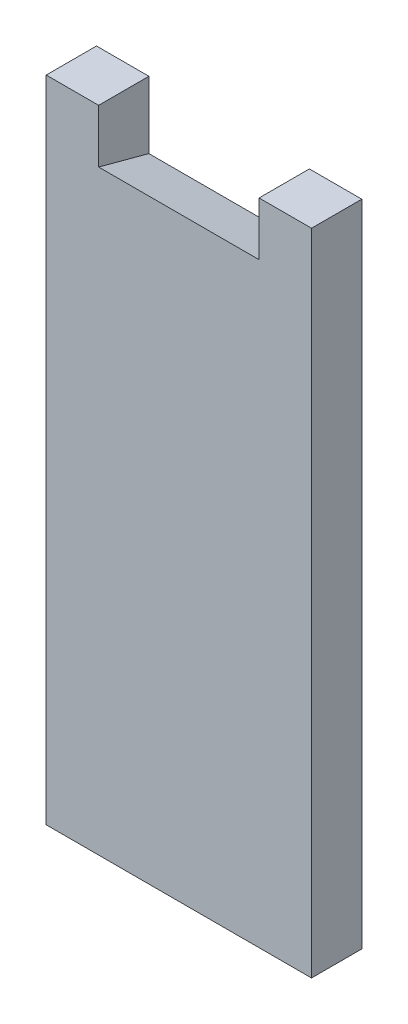
ISO-10303-21;
HEADER;
FILE_DESCRIPTION(('STEP AP214'),'2;1');
FILE_NAME('part.step','',(''),(''),'','','');
FILE_SCHEMA(('AUTOMOTIVE_DESIGN { 1 0 10303 214 1 1 1 1 }'));
ENDSEC;
DATA;
#1=APPLICATION_CONTEXT('core data for automotive mechanical design processes');
#2=APPLICATION_PROTOCOL_DEFINITION('international standard','automotive_design',2000,#1);
#3=PRODUCT_CONTEXT('',#1,'mechanical');
#4=PRODUCT('Part','Part','',(#3));
#5=PRODUCT_RELATED_PRODUCT_CATEGORY('part','',(#4));
#6=PRODUCT_DEFINITION_FORMATION('','',#4);
#7=PRODUCT_DEFINITION_CONTEXT('part definition',#1,'design');
#8=PRODUCT_DEFINITION('design','',#6,#7);
#9=PRODUCT_DEFINITION_SHAPE('','',#8);
#10=(LENGTH_UNIT() NAMED_UNIT(*) SI_UNIT(.MILLI.,.METRE.));
#11=(NAMED_UNIT(*) PLANE_ANGLE_UNIT() SI_UNIT($,.RADIAN.));
#12=(NAMED_UNIT(*) SI_UNIT($,.STERADIAN.) SOLID_ANGLE_UNIT());
#13=UNCERTAINTY_MEASURE_WITH_UNIT(LENGTH_MEASURE(1.E-05),#10,'distance_accuracy_value','');
#14=(GEOMETRIC_REPRESENTATION_CONTEXT(3) GLOBAL_UNCERTAINTY_ASSIGNED_CONTEXT((#13)) GLOBAL_UNIT_ASSIGNED_CONTEXT((#10,
#11,#12)) REPRESENTATION_CONTEXT('',''));
#15=CARTESIAN_POINT('',(0.,0.,0.));
#16=DIRECTION('',(0.,0.,1.));
#17=DIRECTION('',(1.,0.,0.));
#18=AXIS2_PLACEMENT_3D('',#15,#16,#17);
#19=CARTESIAN_POINT('',(0.,0.,9.4));
#20=DIRECTION('',(0.,1.,0.));
#21=DIRECTION('',(0.,0.,1.));
#22=AXIS2_PLACEMENT_3D('',#19,#20,#21);
#23=PLANE('',#22);
#24=DIRECTION('',(1.,0.,0.));
#25=VECTOR('',#24,1.);
#26=CARTESIAN_POINT('',(0.,0.,0.));
#27=LINE('',#26,#25);
#28=CARTESIAN_POINT('',(39.8,0.,0.));
#29=VERTEX_POINT('',#28);
#30=CARTESIAN_POINT('',(49.6,0.,0.));
#31=VERTEX_POINT('',#30);
#32=EDGE_CURVE('E117',#29,#31,#27,.T.);
#33=ORIENTED_EDGE('',*,*,#32,.F.);
#34=DIRECTION('',(0.,0.,-1.));
#35=VECTOR('',#34,1.);
#36=CARTESIAN_POINT('',(39.8,0.,9.4));
#37=LINE('',#36,#35);
#38=CARTESIAN_POINT('',(39.8,0.,9.4));
#39=VERTEX_POINT('',#38);
#40=EDGE_CURVE('E11',#39,#29,#37,.T.);
#41=ORIENTED_EDGE('',*,*,#40,.F.);
#42=DIRECTION('',(1.,0.,0.));
#43=VECTOR('',#42,1.);
#44=CARTESIAN_POINT('',(0.,0.,9.4));
#45=LINE('',#44,#43);
#46=CARTESIAN_POINT('',(49.6,0.,9.4));
#47=VERTEX_POINT('',#46);
#48=EDGE_CURVE('E127',#39,#47,#45,.T.);
#49=ORIENTED_EDGE('',*,*,#48,.T.);
#50=DIRECTION('',(0.,0.,-1.));
#51=VECTOR('',#50,1.);
#52=CARTESIAN_POINT('',(49.6,0.,9.4));
#53=LINE('',#52,#51);
#54=EDGE_CURVE('E58',#47,#31,#53,.T.);
#55=ORIENTED_EDGE('',*,*,#54,.T.);
#56=EDGE_LOOP('',(#33,#41,#49,#55));
#57=FACE_BOUND('',#56,.T.);
#58=ADVANCED_FACE('F39',(#57),#23,.T.);
#59=CARTESIAN_POINT('',(39.8,0.,9.4));
#60=DIRECTION('',(1.,0.,0.));
#61=DIRECTION('',(0.,0.,-1.));
#62=AXIS2_PLACEMENT_3D('',#59,#60,#61);
#63=PLANE('',#62);
#64=DIRECTION('',(0.,-1.,0.));
#65=VECTOR('',#64,1.);
#66=CARTESIAN_POINT('',(39.8,0.,0.));
#67=LINE('',#66,#65);
#68=CARTESIAN_POINT('',(39.8,-12.5187224088526,0.));
#69=VERTEX_POINT('',#68);
#70=EDGE_CURVE('E107',#29,#69,#67,.T.);
#71=ORIENTED_EDGE('',*,*,#70,.T.);
#72=DIRECTION('',(0.,-0.258819045102521,-0.965925826289068));
#73=VECTOR('',#72,1.);
#74=CARTESIAN_POINT('',(39.8,-9.99999999999999,9.4));
#75=LINE('',#74,#73);
#76=CARTESIAN_POINT('',(39.8,-9.99999999999999,9.4));
#77=VERTEX_POINT('',#76);
#78=EDGE_CURVE('E49',#77,#69,#75,.T.);
#79=ORIENTED_EDGE('',*,*,#78,.F.);
#80=DIRECTION('',(0.,-1.,0.));
#81=VECTOR('',#80,1.);
#82=CARTESIAN_POINT('',(39.8,0.,9.4));
#83=LINE('',#82,#81);
#84=EDGE_CURVE('E155',#39,#77,#83,.T.);
#85=ORIENTED_EDGE('',*,*,#84,.F.);
#86=ORIENTED_EDGE('',*,*,#40,.T.);
#87=EDGE_LOOP('',(#71,#79,#85,#86));
#88=FACE_BOUND('',#87,.T.);
#89=ADVANCED_FACE('F164',(#88),#63,.F.);
#90=CARTESIAN_POINT('',(0.,-10.,9.4));
#91=DIRECTION('',(0.,0.965925826289068,-0.258819045102521));
#92=DIRECTION('',(0.,0.258819045102521,0.965925826289068));
#93=AXIS2_PLACEMENT_3D('',#90,#91,#92);
#94=PLANE('',#93);
#95=DIRECTION('',(1.,0.,0.));
#96=VECTOR('',#95,1.);
#97=CARTESIAN_POINT('',(0.,-12.5187224088526,0.));
#98=LINE('',#97,#96);
#99=CARTESIAN_POINT('',(9.79999999999999,-12.5187224088526,0.));
#100=VERTEX_POINT('',#99);
#101=EDGE_CURVE('E104',#100,#69,#98,.T.);
#102=ORIENTED_EDGE('',*,*,#101,.F.);
#103=DIRECTION('',(0.,-0.258819045102521,-0.965925826289068));
#104=VECTOR('',#103,1.);
#105=CARTESIAN_POINT('',(9.79999999999999,-10.,9.4));
#106=LINE('',#105,#104);
#107=CARTESIAN_POINT('',(9.79999999999999,-10.,9.4));
#108=VERTEX_POINT('',#107);
#109=EDGE_CURVE('E43',#108,#100,#106,.T.);
#110=ORIENTED_EDGE('',*,*,#109,.F.);
#111=DIRECTION('',(1.,0.,0.));
#112=VECTOR('',#111,1.);
#113=CARTESIAN_POINT('',(0.,-10.,9.4));
#114=LINE('',#113,#112);
#115=EDGE_CURVE('E151',#108,#77,#114,.T.);
#116=ORIENTED_EDGE('',*,*,#115,.T.);
#117=ORIENTED_EDGE('',*,*,#78,.T.);
#118=EDGE_LOOP('',(#102,#110,#116,#117));
#119=FACE_BOUND('',#118,.T.);
#120=ADVANCED_FACE('F41',(#119),#94,.T.);
#121=CARTESIAN_POINT('',(9.8,0.,9.4));
#122=DIRECTION('',(1.,0.,0.));
#123=DIRECTION('',(0.,1.,0.));
#124=AXIS2_PLACEMENT_3D('',#121,#122,#123);
#125=PLANE('',#124);
#126=DIRECTION('',(0.,-1.,0.));
#127=VECTOR('',#126,1.);
#128=CARTESIAN_POINT('',(9.8,0.,0.));
#129=LINE('',#128,#127);
#130=CARTESIAN_POINT('',(9.8,0.,0.));
#131=VERTEX_POINT('',#130);
#132=EDGE_CURVE('E96',#131,#100,#129,.T.);
#133=ORIENTED_EDGE('',*,*,#132,.F.);
#134=DIRECTION('',(0.,0.,-1.));
#135=VECTOR('',#134,1.);
#136=CARTESIAN_POINT('',(9.8,0.,9.4));
#137=LINE('',#136,#135);
#138=CARTESIAN_POINT('',(9.8,0.,9.4));
#139=VERTEX_POINT('',#138);
#140=EDGE_CURVE('E102',#139,#131,#137,.T.);
#141=ORIENTED_EDGE('',*,*,#140,.F.);
#142=DIRECTION('',(0.,-1.,0.));
#143=VECTOR('',#142,1.);
#144=CARTESIAN_POINT('',(9.8,0.,9.4));
#145=LINE('',#144,#143);
#146=EDGE_CURVE('E100',#139,#108,#145,.T.);
#147=ORIENTED_EDGE('',*,*,#146,.T.);
#148=ORIENTED_EDGE('',*,*,#109,.T.);
#149=EDGE_LOOP('',(#133,#141,#147,#148));
#150=FACE_BOUND('',#149,.T.);
#151=ADVANCED_FACE('F93',(#150),#125,.T.);
#152=CARTESIAN_POINT('',(0.,0.,0.));
#153=VERTEX_POINT('',#152);
#154=EDGE_CURVE('E113',#153,#131,#27,.T.);
#155=ORIENTED_EDGE('',*,*,#154,.F.);
#156=DIRECTION('',(0.,0.,-1.));
#157=VECTOR('',#156,1.);
#158=CARTESIAN_POINT('',(0.,0.,9.4));
#159=LINE('',#158,#157);
#160=CARTESIAN_POINT('',(0.,0.,9.4));
#161=VERTEX_POINT('',#160);
#162=EDGE_CURVE('E135',#161,#153,#159,.T.);
#163=ORIENTED_EDGE('',*,*,#162,.F.);
#164=EDGE_CURVE('E143',#161,#139,#45,.T.);
#165=ORIENTED_EDGE('',*,*,#164,.T.);
#166=ORIENTED_EDGE('',*,*,#140,.T.);
#167=EDGE_LOOP('',(#155,#163,#165,#166));
#168=FACE_BOUND('',#167,.T.);
#169=ADVANCED_FACE('F139',(#168),#23,.T.);
#170=CARTESIAN_POINT('',(0.,0.,9.4));
#171=DIRECTION('',(1.,0.,0.));
#172=DIRECTION('',(0.,1.,0.));
#173=AXIS2_PLACEMENT_3D('',#170,#171,#172);
#174=PLANE('',#173);
#175=DIRECTION('',(0.,-1.,0.));
#176=VECTOR('',#175,1.);
#177=CARTESIAN_POINT('',(0.,0.,0.));
#178=LINE('',#177,#176);
#179=CARTESIAN_POINT('',(0.,-121.4,0.));
#180=VERTEX_POINT('',#179);
#181=EDGE_CURVE('E115',#153,#180,#178,.T.);
#182=ORIENTED_EDGE('',*,*,#181,.T.);
#183=DIRECTION('',(0.,0.,-1.));
#184=VECTOR('',#183,1.);
#185=CARTESIAN_POINT('',(0.,-121.4,9.4));
#186=LINE('',#185,#184);
#187=CARTESIAN_POINT('',(0.,-121.4,9.4));
#188=VERTEX_POINT('',#187);
#189=EDGE_CURVE('E132',#188,#180,#186,.T.);
#190=ORIENTED_EDGE('',*,*,#189,.F.);
#191=DIRECTION('',(0.,-1.,0.));
#192=VECTOR('',#191,1.);
#193=CARTESIAN_POINT('',(0.,0.,9.4));
#194=LINE('',#193,#192);
#195=EDGE_CURVE('E153',#161,#188,#194,.T.);
#196=ORIENTED_EDGE('',*,*,#195,.F.);
#197=ORIENTED_EDGE('',*,*,#162,.T.);
#198=EDGE_LOOP('',(#182,#190,#196,#197));
#199=FACE_BOUND('',#198,.T.);
#200=ADVANCED_FACE('F178',(#199),#174,.F.);
#201=CARTESIAN_POINT('',(0.,-121.4,9.4));
#202=DIRECTION('',(0.,1.,0.));
#203=DIRECTION('',(0.,0.,1.));
#204=AXIS2_PLACEMENT_3D('',#201,#202,#203);
#205=PLANE('',#204);
#206=DIRECTION('',(1.,0.,0.));
#207=VECTOR('',#206,1.);
#208=CARTESIAN_POINT('',(0.,-121.4,0.));
#209=LINE('',#208,#207);
#210=CARTESIAN_POINT('',(49.6,-121.4,0.));
#211=VERTEX_POINT('',#210);
#212=EDGE_CURVE('E121',#180,#211,#209,.T.);
#213=ORIENTED_EDGE('',*,*,#212,.T.);
#214=DIRECTION('',(0.,0.,-1.));
#215=VECTOR('',#214,1.);
#216=CARTESIAN_POINT('',(49.6,-121.4,9.4));
#217=LINE('',#216,#215);
#218=CARTESIAN_POINT('',(49.6,-121.4,9.4));
#219=VERTEX_POINT('',#218);
#220=EDGE_CURVE('E129',#219,#211,#217,.T.);
#221=ORIENTED_EDGE('',*,*,#220,.F.);
#222=DIRECTION('',(1.,0.,0.));
#223=VECTOR('',#222,1.);
#224=CARTESIAN_POINT('',(0.,-121.4,9.4));
#225=LINE('',#224,#223);
#226=EDGE_CURVE('E160',#188,#219,#225,.T.);
#227=ORIENTED_EDGE('',*,*,#226,.F.);
#228=ORIENTED_EDGE('',*,*,#189,.T.);
#229=EDGE_LOOP('',(#213,#221,#227,#228));
#230=FACE_BOUND('',#229,.T.);
#231=ADVANCED_FACE('F175',(#230),#205,.F.);
#232=CARTESIAN_POINT('',(49.6,0.,9.4));
#233=DIRECTION('',(1.,0.,0.));
#234=DIRECTION('',(0.,1.,0.));
#235=AXIS2_PLACEMENT_3D('',#232,#233,#234);
#236=PLANE('',#235);
#237=DIRECTION('',(0.,-1.,0.));
#238=VECTOR('',#237,1.);
#239=CARTESIAN_POINT('',(49.6,0.,0.));
#240=LINE('',#239,#238);
#241=EDGE_CURVE('E124',#31,#211,#240,.T.);
#242=ORIENTED_EDGE('',*,*,#241,.F.);
#243=ORIENTED_EDGE('',*,*,#54,.F.);
#244=DIRECTION('',(0.,-1.,0.));
#245=VECTOR('',#244,1.);
#246=CARTESIAN_POINT('',(49.6,0.,9.4));
#247=LINE('',#246,#245);
#248=EDGE_CURVE('E130',#47,#219,#247,.T.);
#249=ORIENTED_EDGE('',*,*,#248,.T.);
#250=ORIENTED_EDGE('',*,*,#220,.T.);
#251=EDGE_LOOP('',(#242,#243,#249,#250));
#252=FACE_BOUND('',#251,.T.);
#253=ADVANCED_FACE('F172',(#252),#236,.T.);
#254=CARTESIAN_POINT('',(0.,0.,9.4));
#255=DIRECTION('',(0.,0.,1.));
#256=DIRECTION('',(1.,0.,0.));
#257=AXIS2_PLACEMENT_3D('',#254,#255,#256);
#258=PLANE('',#257);
#259=ORIENTED_EDGE('',*,*,#48,.F.);
#260=ORIENTED_EDGE('',*,*,#84,.T.);
#261=ORIENTED_EDGE('',*,*,#115,.F.);
#262=ORIENTED_EDGE('',*,*,#146,.F.);
#263=ORIENTED_EDGE('',*,*,#164,.F.);
#264=ORIENTED_EDGE('',*,*,#195,.T.);
#265=ORIENTED_EDGE('',*,*,#226,.T.);
#266=ORIENTED_EDGE('',*,*,#248,.F.);
#267=EDGE_LOOP('',(#259,#260,#261,#262,#263,#264,#265,#266));
#268=FACE_BOUND('',#267,.T.);
#269=ADVANCED_FACE('F148',(#268),#258,.T.);
#270=CARTESIAN_POINT('',(0.,0.,0.));
#271=DIRECTION('',(0.,0.,1.));
#272=DIRECTION('',(1.,0.,0.));
#273=AXIS2_PLACEMENT_3D('',#270,#271,#272);
#274=PLANE('',#273);
#275=ORIENTED_EDGE('',*,*,#32,.T.);
#276=ORIENTED_EDGE('',*,*,#241,.T.);
#277=ORIENTED_EDGE('',*,*,#212,.F.);
#278=ORIENTED_EDGE('',*,*,#181,.F.);
#279=ORIENTED_EDGE('',*,*,#154,.T.);
#280=ORIENTED_EDGE('',*,*,#132,.T.);
#281=ORIENTED_EDGE('',*,*,#101,.T.);
#282=ORIENTED_EDGE('',*,*,#70,.F.);
#283=EDGE_LOOP('',(#275,#276,#277,#278,#279,#280,#281,#282));
#284=FACE_BOUND('',#283,.T.);
#285=ADVANCED_FACE('F110',(#284),#274,.F.);
#286=CLOSED_SHELL('',(#58,#89,#120,#151,#169,#200,#231,#253,#269,#285));
#287=MANIFOLD_SOLID_BREP('B2',#286);
#288=ADVANCED_BREP_SHAPE_REPRESENTATION('',(#18,#287),#14);
#289=SHAPE_DEFINITION_REPRESENTATION(#9,#288);
ENDSEC;
END-ISO-10303-21;
